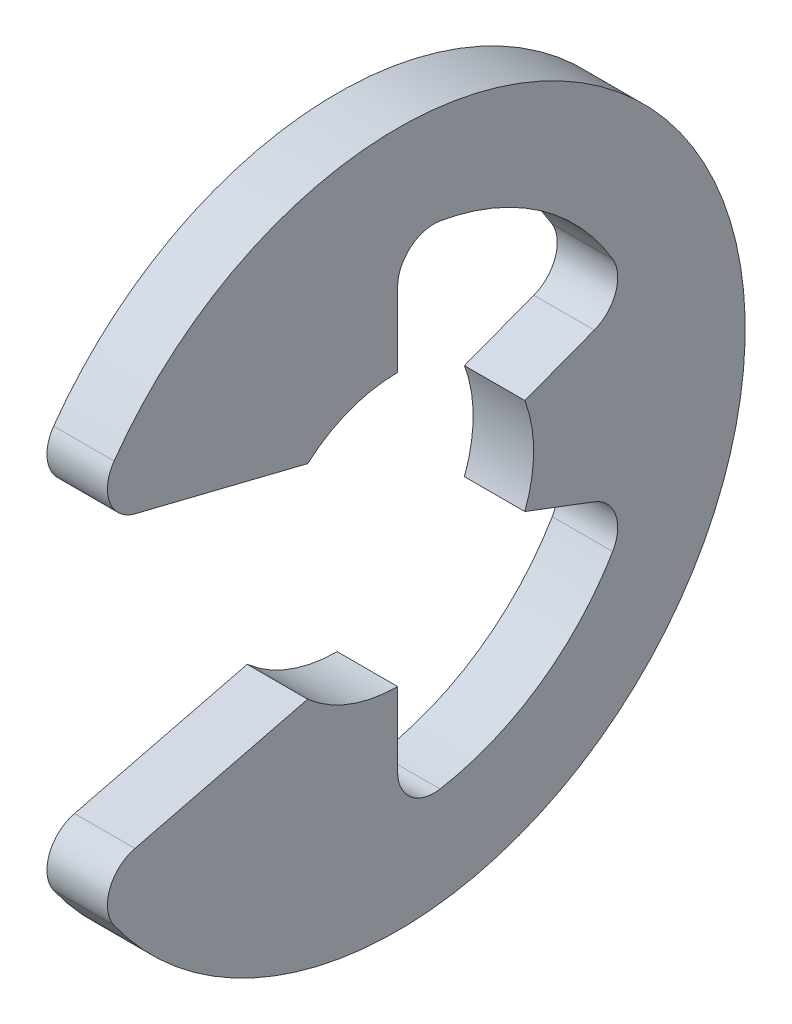
ISO-10303-21;
HEADER;
FILE_DESCRIPTION(('STEP AP214'),'2;1');
FILE_NAME('part.step','',(''),(''),'','','');
FILE_SCHEMA(('AUTOMOTIVE_DESIGN { 1 0 10303 214 1 1 1 1 }'));
ENDSEC;
DATA;
#1=APPLICATION_CONTEXT('core data for automotive mechanical design processes');
#2=APPLICATION_PROTOCOL_DEFINITION('international standard','automotive_design',2000,#1);
#3=PRODUCT_CONTEXT('',#1,'mechanical');
#4=PRODUCT('Part','Part','',(#3));
#5=PRODUCT_RELATED_PRODUCT_CATEGORY('part','',(#4));
#6=PRODUCT_DEFINITION_FORMATION('','',#4);
#7=PRODUCT_DEFINITION_CONTEXT('part definition',#1,'design');
#8=PRODUCT_DEFINITION('design','',#6,#7);
#9=PRODUCT_DEFINITION_SHAPE('','',#8);
#10=(LENGTH_UNIT() NAMED_UNIT(*) SI_UNIT(.MILLI.,.METRE.));
#11=(NAMED_UNIT(*) PLANE_ANGLE_UNIT() SI_UNIT($,.RADIAN.));
#12=(NAMED_UNIT(*) SI_UNIT($,.STERADIAN.) SOLID_ANGLE_UNIT());
#13=UNCERTAINTY_MEASURE_WITH_UNIT(LENGTH_MEASURE(1.E-05),#10,'distance_accuracy_value','');
#14=(GEOMETRIC_REPRESENTATION_CONTEXT(3) GLOBAL_UNCERTAINTY_ASSIGNED_CONTEXT((#13)) GLOBAL_UNIT_ASSIGNED_CONTEXT((#10,
#11,#12)) REPRESENTATION_CONTEXT('',''));
#15=CARTESIAN_POINT('',(0.,0.,0.));
#16=DIRECTION('',(0.,0.,1.));
#17=DIRECTION('',(1.,0.,0.));
#18=AXIS2_PLACEMENT_3D('',#15,#16,#17);
#19=CARTESIAN_POINT('',(-0.3,0.,0.));
#20=DIRECTION('',(-1.,0.,0.));
#21=DIRECTION('',(0.,0.,1.));
#22=AXIS2_PLACEMENT_3D('',#19,#20,#21);
#23=CYLINDRICAL_SURFACE('',#22,3.45);
#24=CARTESIAN_POINT('',(-0.3,0.,0.));
#25=DIRECTION('',(-1.,0.,0.));
#26=DIRECTION('',(0.,0.,1.));
#27=AXIS2_PLACEMENT_3D('',#24,#25,#26);
#28=CIRCLE('',#27,3.45);
#29=CARTESIAN_POINT('',(-0.30000000026632,1.99575242282437,2.81415569341688));
#30=VERTEX_POINT('',#29);
#31=CARTESIAN_POINT('',(-0.30000000026632,-1.99575242301035,2.81415569367911));
#32=VERTEX_POINT('',#31);
#33=EDGE_CURVE('E234',#30,#32,#28,.T.);
#34=ORIENTED_EDGE('',*,*,#33,.F.);
#35=DIRECTION('',(1.,0.,0.));
#36=VECTOR('',#35,1.);
#37=CARTESIAN_POINT('',(0.,1.99575242313794,2.8141556931945));
#38=LINE('',#37,#36);
#39=CARTESIAN_POINT('',(0.30000000026632,1.99575242282437,2.81415569341688));
#40=VERTEX_POINT('',#39);
#41=EDGE_CURVE('E194',#30,#40,#38,.T.);
#42=ORIENTED_EDGE('',*,*,#41,.T.);
#43=CARTESIAN_POINT('',(0.3,0.,0.));
#44=DIRECTION('',(-1.,0.,0.));
#45=DIRECTION('',(0.,0.,1.));
#46=AXIS2_PLACEMENT_3D('',#43,#44,#45);
#47=CIRCLE('',#46,3.45);
#48=CARTESIAN_POINT('',(0.30000000026632,-1.99575242291736,2.814155693548));
#49=VERTEX_POINT('',#48);
#50=EDGE_CURVE('E141',#49,#40,#47,.F.);
#51=ORIENTED_EDGE('',*,*,#50,.F.);
#52=DIRECTION('',(1.,0.,0.));
#53=VECTOR('',#52,1.);
#54=CARTESIAN_POINT('',(0.,-1.99575242332391,2.81415569345674));
#55=LINE('',#54,#53);
#56=EDGE_CURVE('E131',#32,#49,#55,.T.);
#57=ORIENTED_EDGE('',*,*,#56,.F.);
#58=EDGE_LOOP('',(#34,#42,#51,#57));
#59=FACE_BOUND('',#58,.T.);
#60=ADVANCED_FACE('F16',(#59),#23,.T.);
#61=CARTESIAN_POINT('',(-0.3,-1.787499996,2.520504665));
#62=DIRECTION('',(-1.,0.,0.));
#63=DIRECTION('',(0.,0.,1.));
#64=AXIS2_PLACEMENT_3D('',#61,#62,#63);
#65=CYLINDRICAL_SURFACE('',#64,0.36);
#66=DIRECTION('',(1.,0.,0.));
#67=VECTOR('',#66,1.);
#68=CARTESIAN_POINT('',(0.3,-1.43810673771699,2.60724767982199));
#69=LINE('',#68,#67);
#70=CARTESIAN_POINT('',(-0.30000000047706,-1.4381067374026,2.60724768008867));
#71=VERTEX_POINT('',#70);
#72=CARTESIAN_POINT('',(0.30000000047706,-1.4381067374026,2.60724768008867));
#73=VERTEX_POINT('',#72);
#74=EDGE_CURVE('E136',#71,#73,#69,.T.);
#75=ORIENTED_EDGE('',*,*,#74,.F.);
#76=CARTESIAN_POINT('',(-0.30000000047706,-1.787499996,2.520504665));
#77=DIRECTION('',(-1.,0.,0.));
#78=DIRECTION('',(0.,0.,1.));
#79=AXIS2_PLACEMENT_3D('',#76,#77,#78);
#80=CIRCLE('',#79,0.36);
#81=EDGE_CURVE('E232',#32,#71,#80,.T.);
#82=ORIENTED_EDGE('',*,*,#81,.F.);
#83=ORIENTED_EDGE('',*,*,#56,.T.);
#84=CARTESIAN_POINT('',(0.30000000047706,-1.787499996,2.520504665));
#85=DIRECTION('',(-1.,0.,0.));
#86=DIRECTION('',(0.,0.,1.));
#87=AXIS2_PLACEMENT_3D('',#84,#85,#86);
#88=CIRCLE('',#87,0.36);
#89=EDGE_CURVE('E19',#73,#49,#88,.F.);
#90=ORIENTED_EDGE('',*,*,#89,.F.);
#91=EDGE_LOOP('',(#75,#82,#83,#90));
#92=FACE_BOUND('',#91,.T.);
#93=ADVANCED_FACE('F135',(#92),#65,.T.);
#94=CARTESIAN_POINT('',(0.3,-1.555353856,3.079508789));
#95=DIRECTION('',(0.,-0.970536829837772,-0.240952820959724));
#96=DIRECTION('',(0.,0.240952820959724,-0.970536829837771));
#97=AXIS2_PLACEMENT_3D('',#94,#95,#96);
#98=PLANE('',#97);
#99=DIRECTION('',(0.,-0.240952820351647,0.970536829988737));
#100=VECTOR('',#99,1.);
#101=CARTESIAN_POINT('',(0.3,-1.0125,0.892941067));
#102=LINE('',#101,#100);
#103=CARTESIAN_POINT('',(0.3,-1.01250000016704,0.892941067294897));
#104=VERTEX_POINT('',#103);
#105=EDGE_CURVE('E142',#104,#73,#102,.T.);
#106=ORIENTED_EDGE('',*,*,#105,.F.);
#107=DIRECTION('',(1.,0.,0.));
#108=VECTOR('',#107,1.);
#109=CARTESIAN_POINT('',(0.,-1.01250000024025,0.89294106721188));
#110=LINE('',#109,#108);
#111=CARTESIAN_POINT('',(-0.3,-1.01250000016704,0.892941067294897));
#112=VERTEX_POINT('',#111);
#113=EDGE_CURVE('E149',#112,#104,#110,.T.);
#114=ORIENTED_EDGE('',*,*,#113,.F.);
#115=DIRECTION('',(0.,0.240952820351647,-0.970536829988737));
#116=VECTOR('',#115,1.);
#117=CARTESIAN_POINT('',(-0.3,-1.438106737,2.60724768));
#118=LINE('',#117,#116);
#119=EDGE_CURVE('E147',#71,#112,#118,.T.);
#120=ORIENTED_EDGE('',*,*,#119,.F.);
#121=ORIENTED_EDGE('',*,*,#74,.T.);
#122=EDGE_LOOP('',(#106,#114,#120,#121));
#123=FACE_BOUND('',#122,.T.);
#124=ADVANCED_FACE('F144',(#123),#98,.F.);
#125=CARTESIAN_POINT('',(0.3,0.,0.));
#126=DIRECTION('',(-1.,0.,0.));
#127=DIRECTION('',(0.,0.,1.));
#128=AXIS2_PLACEMENT_3D('',#125,#126,#127);
#129=CYLINDRICAL_SURFACE('',#128,1.35);
#130=CARTESIAN_POINT('',(0.3,0.,0.));
#131=DIRECTION('',(-1.,0.,0.));
#132=DIRECTION('',(0.,0.,1.));
#133=AXIS2_PLACEMENT_3D('',#130,#131,#132);
#134=CIRCLE('',#133,1.35);
#135=CARTESIAN_POINT('',(0.3,-1.35,0.));
#136=VERTEX_POINT('',#135);
#137=EDGE_CURVE('E155',#136,#104,#134,.T.);
#138=ORIENTED_EDGE('',*,*,#137,.F.);
#139=DIRECTION('',(1.,0.,0.));
#140=VECTOR('',#139,1.);
#141=CARTESIAN_POINT('',(0.3,-1.35,0.));
#142=LINE('',#141,#140);
#143=CARTESIAN_POINT('',(-0.3,-1.35,0.));
#144=VERTEX_POINT('',#143);
#145=EDGE_CURVE('E190',#144,#136,#142,.T.);
#146=ORIENTED_EDGE('',*,*,#145,.F.);
#147=CARTESIAN_POINT('',(-0.3,0.,0.));
#148=DIRECTION('',(-1.,0.,0.));
#149=DIRECTION('',(0.,0.,1.));
#150=AXIS2_PLACEMENT_3D('',#147,#148,#149);
#151=CIRCLE('',#150,1.35);
#152=EDGE_CURVE('E229',#112,#144,#151,.F.);
#153=ORIENTED_EDGE('',*,*,#152,.F.);
#154=ORIENTED_EDGE('',*,*,#113,.T.);
#155=EDGE_LOOP('',(#138,#146,#153,#154));
#156=FACE_BOUND('',#155,.T.);
#157=ADVANCED_FACE('F326',(#156),#129,.F.);
#158=CARTESIAN_POINT('',(0.3,-1.35,0.));
#159=DIRECTION('',(0.,0.,1.));
#160=DIRECTION('',(1.,0.,0.));
#161=AXIS2_PLACEMENT_3D('',#158,#159,#160);
#162=PLANE('',#161);
#163=DIRECTION('',(0.,1.,0.));
#164=VECTOR('',#163,1.);
#165=CARTESIAN_POINT('',(-0.3,0.,0.));
#166=LINE('',#165,#164);
#167=CARTESIAN_POINT('',(-0.3,-2.086591652,0.));
#168=VERTEX_POINT('',#167);
#169=EDGE_CURVE('E228',#144,#168,#166,.F.);
#170=ORIENTED_EDGE('',*,*,#169,.F.);
#171=ORIENTED_EDGE('',*,*,#145,.T.);
#172=DIRECTION('',(0.,1.,0.));
#173=VECTOR('',#172,1.);
#174=CARTESIAN_POINT('',(0.3,0.,0.));
#175=LINE('',#174,#173);
#176=CARTESIAN_POINT('',(0.3,-2.086591652,0.));
#177=VERTEX_POINT('',#176);
#178=EDGE_CURVE('E238',#177,#136,#175,.T.);
#179=ORIENTED_EDGE('',*,*,#178,.F.);
#180=DIRECTION('',(1.,0.,0.));
#181=VECTOR('',#180,1.);
#182=CARTESIAN_POINT('',(0.,-2.086591652,0.));
#183=LINE('',#182,#181);
#184=EDGE_CURVE('E188',#168,#177,#183,.T.);
#185=ORIENTED_EDGE('',*,*,#184,.F.);
#186=EDGE_LOOP('',(#170,#171,#179,#185));
#187=FACE_BOUND('',#186,.T.);
#188=ADVANCED_FACE('F322',(#187),#162,.F.);
#189=CARTESIAN_POINT('',(0.3,-2.086591652,-0.36));
#190=DIRECTION('',(-1.,0.,0.));
#191=DIRECTION('',(0.,0.,1.));
#192=AXIS2_PLACEMENT_3D('',#189,#190,#191);
#193=CYLINDRICAL_SURFACE('',#192,0.36);
#194=CARTESIAN_POINT('',(-0.3,-2.086591652,-0.36));
#195=DIRECTION('',(-1.,0.,0.));
#196=DIRECTION('',(0.,0.,1.));
#197=AXIS2_PLACEMENT_3D('',#194,#195,#196);
#198=CIRCLE('',#197,0.36);
#199=CARTESIAN_POINT('',(-0.3,-2.44135037970149,-0.421206581216385));
#200=VERTEX_POINT('',#199);
#201=EDGE_CURVE('E225',#168,#200,#198,.F.);
#202=ORIENTED_EDGE('',*,*,#201,.F.);
#203=ORIENTED_EDGE('',*,*,#184,.T.);
#204=CARTESIAN_POINT('',(0.3,-2.086591652,-0.36));
#205=DIRECTION('',(-1.,0.,0.));
#206=DIRECTION('',(0.,0.,1.));
#207=AXIS2_PLACEMENT_3D('',#204,#205,#206);
#208=CIRCLE('',#207,0.36);
#209=CARTESIAN_POINT('',(0.3,-2.44135037938356,-0.421206581161533));
#210=VERTEX_POINT('',#209);
#211=EDGE_CURVE('E239',#210,#177,#208,.T.);
#212=ORIENTED_EDGE('',*,*,#211,.F.);
#213=DIRECTION('',(1.,0.,0.));
#214=VECTOR('',#213,1.);
#215=CARTESIAN_POINT('',(0.,-2.44135037974637,-0.421206580956243));
#216=LINE('',#215,#214);
#217=EDGE_CURVE('E186',#200,#210,#216,.T.);
#218=ORIENTED_EDGE('',*,*,#217,.F.);
#219=EDGE_LOOP('',(#202,#203,#212,#218));
#220=FACE_BOUND('',#219,.T.);
#221=ADVANCED_FACE('F318',(#220),#193,.F.);
#222=CARTESIAN_POINT('',(0.3,0.,0.));
#223=DIRECTION('',(-1.,0.,0.));
#224=DIRECTION('',(0.,0.,1.));
#225=AXIS2_PLACEMENT_3D('',#222,#223,#224);
#226=CYLINDRICAL_SURFACE('',#225,2.477419355);
#227=CARTESIAN_POINT('',(0.3,0.,0.));
#228=DIRECTION('',(-1.,0.,0.));
#229=DIRECTION('',(0.,0.,1.));
#230=AXIS2_PLACEMENT_3D('',#227,#228,#229);
#231=CIRCLE('',#230,2.477419355);
#232=CARTESIAN_POINT('',(0.300000000106782,-1.25715038318439,-2.13475515555327));
#233=VERTEX_POINT('',#232);
#234=EDGE_CURVE('E242',#233,#210,#231,.T.);
#235=ORIENTED_EDGE('',*,*,#234,.F.);
#236=DIRECTION('',(1.,0.,0.));
#237=VECTOR('',#236,1.);
#238=CARTESIAN_POINT('',(0.,-1.2571503832457,-2.13475515541723));
#239=LINE('',#238,#237);
#240=CARTESIAN_POINT('',(-0.300000000106782,-1.25715038314069,-2.13475515547907));
#241=VERTEX_POINT('',#240);
#242=EDGE_CURVE('E184',#241,#233,#239,.T.);
#243=ORIENTED_EDGE('',*,*,#242,.F.);
#244=CARTESIAN_POINT('',(-0.3,0.,0.));
#245=DIRECTION('',(-1.,0.,0.));
#246=DIRECTION('',(0.,0.,1.));
#247=AXIS2_PLACEMENT_3D('',#244,#245,#246);
#248=CIRCLE('',#247,2.477419355);
#249=EDGE_CURVE('E222',#200,#241,#248,.F.);
#250=ORIENTED_EDGE('',*,*,#249,.F.);
#251=ORIENTED_EDGE('',*,*,#217,.T.);
#252=EDGE_LOOP('',(#235,#243,#250,#251));
#253=FACE_BOUND('',#252,.T.);
#254=ADVANCED_FACE('F314',(#253),#226,.F.);
#255=CARTESIAN_POINT('',(0.3,-1.074470718,-1.824548547));
#256=DIRECTION('',(-1.,0.,0.));
#257=DIRECTION('',(0.,0.,1.));
#258=AXIS2_PLACEMENT_3D('',#255,#256,#257);
#259=CYLINDRICAL_SURFACE('',#258,0.36);
#260=CARTESIAN_POINT('',(-0.30000000018253,-1.074470718,-1.824548547));
#261=DIRECTION('',(-1.,0.,0.));
#262=DIRECTION('',(0.,0.,1.));
#263=AXIS2_PLACEMENT_3D('',#260,#261,#262);
#264=CIRCLE('',#263,0.36);
#265=CARTESIAN_POINT('',(-0.30000000018253,-0.737721553813485,-1.95182776745112));
#266=VERTEX_POINT('',#265);
#267=EDGE_CURVE('E219',#241,#266,#264,.F.);
#268=ORIENTED_EDGE('',*,*,#267,.F.);
#269=ORIENTED_EDGE('',*,*,#242,.T.);
#270=CARTESIAN_POINT('',(0.30000000018253,-1.074470718,-1.824548547));
#271=DIRECTION('',(-1.,0.,0.));
#272=DIRECTION('',(0.,0.,1.));
#273=AXIS2_PLACEMENT_3D('',#270,#271,#272);
#274=CIRCLE('',#273,0.36);
#275=CARTESIAN_POINT('',(0.30000000018253,-0.737721553813485,-1.95182776745112));
#276=VERTEX_POINT('',#275);
#277=EDGE_CURVE('E245',#276,#233,#274,.T.);
#278=ORIENTED_EDGE('',*,*,#277,.F.);
#279=DIRECTION('',(1.,0.,0.));
#280=VECTOR('',#279,1.);
#281=CARTESIAN_POINT('',(0.3,-0.737721553375208,-1.95182776723615));
#282=LINE('',#281,#280);
#283=EDGE_CURVE('E182',#266,#276,#282,.T.);
#284=ORIENTED_EDGE('',*,*,#283,.F.);
#285=EDGE_LOOP('',(#268,#269,#278,#284));
#286=FACE_BOUND('',#285,.T.);
#287=ADVANCED_FACE('F311',(#286),#259,.F.);
#288=CARTESIAN_POINT('',(0.3,-0.477297077,-1.262809368));
#289=DIRECTION('',(0.,0.935414346597288,-0.353553390847789));
#290=DIRECTION('',(0.,0.353553390847789,0.935414346597288));
#291=AXIS2_PLACEMENT_3D('',#288,#289,#290);
#292=PLANE('',#291);
#293=DIRECTION('',(0.,-0.353553391696009,-0.935414346276691));
#294=VECTOR('',#293,1.);
#295=CARTESIAN_POINT('',(0.3,-0.477297077,-1.262809368));
#296=LINE('',#295,#294);
#297=CARTESIAN_POINT('',(0.3,-0.477297077049589,-1.2628093681312));
#298=VERTEX_POINT('',#297);
#299=EDGE_CURVE('E248',#298,#276,#296,.T.);
#300=ORIENTED_EDGE('',*,*,#299,.F.);
#301=DIRECTION('',(1.,0.,0.));
#302=VECTOR('',#301,1.);
#303=CARTESIAN_POINT('',(0.,-0.477297077049588,-1.2628093681312));
#304=LINE('',#303,#302);
#305=CARTESIAN_POINT('',(-0.3,-0.477297077049589,-1.2628093681312));
#306=VERTEX_POINT('',#305);
#307=EDGE_CURVE('E180',#306,#298,#304,.T.);
#308=ORIENTED_EDGE('',*,*,#307,.F.);
#309=DIRECTION('',(0.,0.353553391696009,0.935414346276691));
#310=VECTOR('',#309,1.);
#311=CARTESIAN_POINT('',(-0.3,-0.737721554,-1.951827767));
#312=LINE('',#311,#310);
#313=EDGE_CURVE('E218',#266,#306,#312,.T.);
#314=ORIENTED_EDGE('',*,*,#313,.F.);
#315=ORIENTED_EDGE('',*,*,#283,.T.);
#316=EDGE_LOOP('',(#300,#308,#314,#315));
#317=FACE_BOUND('',#316,.T.);
#318=ADVANCED_FACE('F306',(#317),#292,.F.);
#319=CARTESIAN_POINT('',(0.3,0.,0.));
#320=DIRECTION('',(-1.,0.,0.));
#321=DIRECTION('',(0.,0.,1.));
#322=AXIS2_PLACEMENT_3D('',#319,#320,#321);
#323=CYLINDRICAL_SURFACE('',#322,1.35);
#324=CARTESIAN_POINT('',(0.3,0.,0.));
#325=DIRECTION('',(-1.,0.,0.));
#326=DIRECTION('',(0.,0.,1.));
#327=AXIS2_PLACEMENT_3D('',#324,#325,#326);
#328=CIRCLE('',#327,1.35);
#329=CARTESIAN_POINT('',(0.3,0.477297077024794,-1.2628093680656));
#330=VERTEX_POINT('',#329);
#331=EDGE_CURVE('E249',#330,#298,#328,.T.);
#332=ORIENTED_EDGE('',*,*,#331,.F.);
#333=DIRECTION('',(1.,0.,0.));
#334=VECTOR('',#333,1.);
#335=CARTESIAN_POINT('',(0.3,0.477297077,-1.262809368));
#336=LINE('',#335,#334);
#337=CARTESIAN_POINT('',(-0.3,0.477297077024794,-1.2628093680656));
#338=VERTEX_POINT('',#337);
#339=EDGE_CURVE('E178',#338,#330,#336,.T.);
#340=ORIENTED_EDGE('',*,*,#339,.F.);
#341=CARTESIAN_POINT('',(-0.3,0.,0.));
#342=DIRECTION('',(-1.,0.,0.));
#343=DIRECTION('',(0.,0.,1.));
#344=AXIS2_PLACEMENT_3D('',#341,#342,#343);
#345=CIRCLE('',#344,1.35);
#346=EDGE_CURVE('E215',#306,#338,#345,.F.);
#347=ORIENTED_EDGE('',*,*,#346,.F.);
#348=ORIENTED_EDGE('',*,*,#307,.T.);
#349=EDGE_LOOP('',(#332,#340,#347,#348));
#350=FACE_BOUND('',#349,.T.);
#351=ADVANCED_FACE('F301',(#350),#323,.F.);
#352=CARTESIAN_POINT('',(0.3,0.477297077,-1.262809368));
#353=DIRECTION('',(0.,-0.935414346597288,-0.353553390847789));
#354=DIRECTION('',(0.,0.353553390847789,-0.935414346597288));
#355=AXIS2_PLACEMENT_3D('',#352,#353,#354);
#356=PLANE('',#355);
#357=DIRECTION('',(0.,0.353553391696009,-0.935414346276691));
#358=VECTOR('',#357,1.);
#359=CARTESIAN_POINT('',(-0.3,0.477297077,-1.262809368));
#360=LINE('',#359,#358);
#361=CARTESIAN_POINT('',(-0.30000000018253,0.737721553670196,-1.95182776750528));
#362=VERTEX_POINT('',#361);
#363=EDGE_CURVE('E214',#338,#362,#360,.T.);
#364=ORIENTED_EDGE('',*,*,#363,.F.);
#365=ORIENTED_EDGE('',*,*,#339,.T.);
#366=DIRECTION('',(0.,-0.353553391696009,0.935414346276691));
#367=VECTOR('',#366,1.);
#368=CARTESIAN_POINT('',(0.3,0.737721554,-1.951827767));
#369=LINE('',#368,#367);
#370=CARTESIAN_POINT('',(0.30000000018253,0.737721553670196,-1.95182776750528));
#371=VERTEX_POINT('',#370);
#372=EDGE_CURVE('E252',#371,#330,#369,.T.);
#373=ORIENTED_EDGE('',*,*,#372,.F.);
#374=DIRECTION('',(1.,0.,0.));
#375=VECTOR('',#374,1.);
#376=CARTESIAN_POINT('',(0.,0.73772155308863,-1.95182776734447));
#377=LINE('',#376,#375);
#378=EDGE_CURVE('E176',#362,#371,#377,.T.);
#379=ORIENTED_EDGE('',*,*,#378,.F.);
#380=EDGE_LOOP('',(#364,#365,#373,#379));
#381=FACE_BOUND('',#380,.T.);
#382=ADVANCED_FACE('F296',(#381),#356,.F.);
#383=CARTESIAN_POINT('',(0.3,1.074470718,-1.824548547));
#384=DIRECTION('',(-1.,0.,0.));
#385=DIRECTION('',(0.,0.,1.));
#386=AXIS2_PLACEMENT_3D('',#383,#384,#385);
#387=CYLINDRICAL_SURFACE('',#386,0.36);
#388=CARTESIAN_POINT('',(-0.30000000018253,1.074470718,-1.824548547));
#389=DIRECTION('',(-1.,0.,0.));
#390=DIRECTION('',(0.,0.,1.));
#391=AXIS2_PLACEMENT_3D('',#388,#389,#390);
#392=CIRCLE('',#391,0.36);
#393=CARTESIAN_POINT('',(-0.300000000106782,1.25715038322809,-2.13475515562748));
#394=VERTEX_POINT('',#393);
#395=EDGE_CURVE('E211',#362,#394,#392,.F.);
#396=ORIENTED_EDGE('',*,*,#395,.F.);
#397=ORIENTED_EDGE('',*,*,#378,.T.);
#398=CARTESIAN_POINT('',(0.30000000018253,1.074470718,-1.824548547));
#399=DIRECTION('',(-1.,0.,0.));
#400=DIRECTION('',(0.,0.,1.));
#401=AXIS2_PLACEMENT_3D('',#398,#399,#400);
#402=CIRCLE('',#401,0.36);
#403=CARTESIAN_POINT('',(0.300000000106782,1.25715038318439,-2.13475515555327));
#404=VERTEX_POINT('',#403);
#405=EDGE_CURVE('E253',#404,#371,#402,.T.);
#406=ORIENTED_EDGE('',*,*,#405,.F.);
#407=DIRECTION('',(1.,0.,0.));
#408=VECTOR('',#407,1.);
#409=CARTESIAN_POINT('',(0.,1.2571503833331,-2.13475515556563));
#410=LINE('',#409,#408);
#411=EDGE_CURVE('E174',#394,#404,#410,.T.);
#412=ORIENTED_EDGE('',*,*,#411,.F.);
#413=EDGE_LOOP('',(#396,#397,#406,#412));
#414=FACE_BOUND('',#413,.T.);
#415=ADVANCED_FACE('F333',(#414),#387,.F.);
#416=CARTESIAN_POINT('',(0.3,0.,0.));
#417=DIRECTION('',(-1.,0.,0.));
#418=DIRECTION('',(0.,0.,1.));
#419=AXIS2_PLACEMENT_3D('',#416,#417,#418);
#420=CYLINDRICAL_SURFACE('',#419,2.477419355);
#421=CARTESIAN_POINT('',(-0.3,0.,0.));
#422=DIRECTION('',(-1.,0.,0.));
#423=DIRECTION('',(0.,0.,1.));
#424=AXIS2_PLACEMENT_3D('',#421,#422,#423);
#425=CIRCLE('',#424,2.477419355);
#426=CARTESIAN_POINT('',(-0.3,2.44135037906564,-0.421206581106681));
#427=VERTEX_POINT('',#426);
#428=EDGE_CURVE('E208',#394,#427,#425,.F.);
#429=ORIENTED_EDGE('',*,*,#428,.F.);
#430=ORIENTED_EDGE('',*,*,#411,.T.);
#431=CARTESIAN_POINT('',(0.3,0.,0.));
#432=DIRECTION('',(-1.,0.,0.));
#433=DIRECTION('',(0.,0.,1.));
#434=AXIS2_PLACEMENT_3D('',#431,#432,#433);
#435=CIRCLE('',#434,2.477419355);
#436=CARTESIAN_POINT('',(0.3,2.44135037938356,-0.421206581161533));
#437=VERTEX_POINT('',#436);
#438=EDGE_CURVE('E256',#437,#404,#435,.T.);
#439=ORIENTED_EDGE('',*,*,#438,.F.);
#440=DIRECTION('',(1.,0.,0.));
#441=VECTOR('',#440,1.);
#442=CARTESIAN_POINT('',(0.,2.44135037911052,-0.421206580846538));
#443=LINE('',#442,#441);
#444=EDGE_CURVE('E158',#427,#437,#443,.T.);
#445=ORIENTED_EDGE('',*,*,#444,.F.);
#446=EDGE_LOOP('',(#429,#430,#439,#445));
#447=FACE_BOUND('',#446,.T.);
#448=ADVANCED_FACE('F336',(#447),#420,.F.);
#449=CARTESIAN_POINT('',(0.3,2.086591652,-0.36));
#450=DIRECTION('',(-1.,0.,0.));
#451=DIRECTION('',(0.,0.,1.));
#452=AXIS2_PLACEMENT_3D('',#449,#450,#451);
#453=CYLINDRICAL_SURFACE('',#452,0.36);
#454=CARTESIAN_POINT('',(-0.3,2.086591652,-0.36));
#455=DIRECTION('',(-1.,0.,0.));
#456=DIRECTION('',(0.,0.,1.));
#457=AXIS2_PLACEMENT_3D('',#454,#455,#456);
#458=CIRCLE('',#457,0.36);
#459=CARTESIAN_POINT('',(-0.3,2.086591652,0.));
#460=VERTEX_POINT('',#459);
#461=EDGE_CURVE('E205',#427,#460,#458,.F.);
#462=ORIENTED_EDGE('',*,*,#461,.F.);
#463=ORIENTED_EDGE('',*,*,#444,.T.);
#464=CARTESIAN_POINT('',(0.3,2.086591652,-0.36));
#465=DIRECTION('',(-1.,0.,0.));
#466=DIRECTION('',(0.,0.,1.));
#467=AXIS2_PLACEMENT_3D('',#464,#465,#466);
#468=CIRCLE('',#467,0.36);
#469=CARTESIAN_POINT('',(0.3,2.086591652,0.));
#470=VERTEX_POINT('',#469);
#471=EDGE_CURVE('E259',#470,#437,#468,.T.);
#472=ORIENTED_EDGE('',*,*,#471,.F.);
#473=DIRECTION('',(1.,0.,0.));
#474=VECTOR('',#473,1.);
#475=CARTESIAN_POINT('',(0.3,2.086591652,0.));
#476=LINE('',#475,#474);
#477=EDGE_CURVE('E156',#460,#470,#476,.T.);
#478=ORIENTED_EDGE('',*,*,#477,.F.);
#479=EDGE_LOOP('',(#462,#463,#472,#478));
#480=FACE_BOUND('',#479,.T.);
#481=ADVANCED_FACE('F339',(#480),#453,.F.);
#482=CARTESIAN_POINT('',(0.3,1.35,0.));
#483=DIRECTION('',(0.,0.,1.));
#484=DIRECTION('',(1.,0.,0.));
#485=AXIS2_PLACEMENT_3D('',#482,#483,#484);
#486=PLANE('',#485);
#487=DIRECTION('',(0.,1.,0.));
#488=VECTOR('',#487,1.);
#489=CARTESIAN_POINT('',(0.3,0.,0.));
#490=LINE('',#489,#488);
#491=CARTESIAN_POINT('',(0.3,1.35,0.));
#492=VERTEX_POINT('',#491);
#493=EDGE_CURVE('E162',#492,#470,#490,.T.);
#494=ORIENTED_EDGE('',*,*,#493,.F.);
#495=DIRECTION('',(1.,0.,0.));
#496=VECTOR('',#495,1.);
#497=CARTESIAN_POINT('',(0.,1.35,0.));
#498=LINE('',#497,#496);
#499=CARTESIAN_POINT('',(-0.3,1.35,0.));
#500=VERTEX_POINT('',#499);
#501=EDGE_CURVE('E168',#500,#492,#498,.T.);
#502=ORIENTED_EDGE('',*,*,#501,.F.);
#503=DIRECTION('',(0.,1.,0.));
#504=VECTOR('',#503,1.);
#505=CARTESIAN_POINT('',(-0.3,0.,0.));
#506=LINE('',#505,#504);
#507=EDGE_CURVE('E204',#460,#500,#506,.F.);
#508=ORIENTED_EDGE('',*,*,#507,.F.);
#509=ORIENTED_EDGE('',*,*,#477,.T.);
#510=EDGE_LOOP('',(#494,#502,#508,#509));
#511=FACE_BOUND('',#510,.T.);
#512=ADVANCED_FACE('F268',(#511),#486,.F.);
#513=CARTESIAN_POINT('',(0.3,0.,0.));
#514=DIRECTION('',(1.,0.,0.));
#515=DIRECTION('',(0.,0.,-1.));
#516=AXIS2_PLACEMENT_3D('',#513,#514,#515);
#517=PLANE('',#516);
#518=ORIENTED_EDGE('',*,*,#178,.T.);
#519=ORIENTED_EDGE('',*,*,#137,.T.);
#520=ORIENTED_EDGE('',*,*,#105,.T.);
#521=ORIENTED_EDGE('',*,*,#89,.T.);
#522=ORIENTED_EDGE('',*,*,#50,.T.);
#523=CARTESIAN_POINT('',(0.30000000047706,1.787499996,2.520504665));
#524=DIRECTION('',(-1.,0.,0.));
#525=DIRECTION('',(0.,0.,1.));
#526=AXIS2_PLACEMENT_3D('',#523,#524,#525);
#527=CIRCLE('',#526,0.36);
#528=CARTESIAN_POINT('',(0.30000000047706,1.4381067374877,2.60724768018375));
#529=VERTEX_POINT('',#528);
#530=EDGE_CURVE('E197',#529,#40,#527,.T.);
#531=ORIENTED_EDGE('',*,*,#530,.F.);
#532=DIRECTION('',(0.,0.240952820959724,0.970536829837771));
#533=VECTOR('',#532,1.);
#534=CARTESIAN_POINT('',(0.3,1.555353856,3.079508789));
#535=LINE('',#534,#533);
#536=CARTESIAN_POINT('',(0.3,1.01249999972046,0.892941067400998));
#537=VERTEX_POINT('',#536);
#538=EDGE_CURVE('E164',#537,#529,#535,.T.);
#539=ORIENTED_EDGE('',*,*,#538,.F.);
#540=CARTESIAN_POINT('',(0.3,0.,0.));
#541=DIRECTION('',(-1.,0.,0.));
#542=DIRECTION('',(0.,0.,1.));
#543=AXIS2_PLACEMENT_3D('',#540,#541,#542);
#544=CIRCLE('',#543,1.35);
#545=EDGE_CURVE('E170',#492,#537,#544,.F.);
#546=ORIENTED_EDGE('',*,*,#545,.F.);
#547=ORIENTED_EDGE('',*,*,#493,.T.);
#548=ORIENTED_EDGE('',*,*,#471,.T.);
#549=ORIENTED_EDGE('',*,*,#438,.T.);
#550=ORIENTED_EDGE('',*,*,#405,.T.);
#551=ORIENTED_EDGE('',*,*,#372,.T.);
#552=ORIENTED_EDGE('',*,*,#331,.T.);
#553=ORIENTED_EDGE('',*,*,#299,.T.);
#554=ORIENTED_EDGE('',*,*,#277,.T.);
#555=ORIENTED_EDGE('',*,*,#234,.T.);
#556=ORIENTED_EDGE('',*,*,#211,.T.);
#557=EDGE_LOOP('',(#518,#519,#520,#521,#522,#531,#539,#546,#547,#548,#549,#550,#551,#552,#553,
#554,#555,#556));
#558=FACE_BOUND('',#557,.T.);
#559=ADVANCED_FACE('F153',(#558),#517,.T.);
#560=CARTESIAN_POINT('',(-0.3,0.,0.));
#561=DIRECTION('',(1.,0.,0.));
#562=DIRECTION('',(0.,0.,-1.));
#563=AXIS2_PLACEMENT_3D('',#560,#561,#562);
#564=PLANE('',#563);
#565=DIRECTION('',(0.,0.240952820959724,0.970536829837771));
#566=VECTOR('',#565,1.);
#567=CARTESIAN_POINT('',(-0.3,1.555353856,3.079508789));
#568=LINE('',#567,#566);
#569=CARTESIAN_POINT('',(-0.30000000047706,1.4381067374877,2.60724768018375));
#570=VERTEX_POINT('',#569);
#571=CARTESIAN_POINT('',(-0.3,1.01249999972046,0.892941067400998));
#572=VERTEX_POINT('',#571);
#573=EDGE_CURVE('E167',#570,#572,#568,.F.);
#574=ORIENTED_EDGE('',*,*,#573,.F.);
#575=CARTESIAN_POINT('',(-0.30000000047706,1.787499996,2.520504665));
#576=DIRECTION('',(-1.,0.,0.));
#577=DIRECTION('',(0.,0.,1.));
#578=AXIS2_PLACEMENT_3D('',#575,#576,#577);
#579=CIRCLE('',#578,0.36);
#580=EDGE_CURVE('E33',#30,#570,#579,.F.);
#581=ORIENTED_EDGE('',*,*,#580,.F.);
#582=ORIENTED_EDGE('',*,*,#33,.T.);
#583=ORIENTED_EDGE('',*,*,#81,.T.);
#584=ORIENTED_EDGE('',*,*,#119,.T.);
#585=ORIENTED_EDGE('',*,*,#152,.T.);
#586=ORIENTED_EDGE('',*,*,#169,.T.);
#587=ORIENTED_EDGE('',*,*,#201,.T.);
#588=ORIENTED_EDGE('',*,*,#249,.T.);
#589=ORIENTED_EDGE('',*,*,#267,.T.);
#590=ORIENTED_EDGE('',*,*,#313,.T.);
#591=ORIENTED_EDGE('',*,*,#346,.T.);
#592=ORIENTED_EDGE('',*,*,#363,.T.);
#593=ORIENTED_EDGE('',*,*,#395,.T.);
#594=ORIENTED_EDGE('',*,*,#428,.T.);
#595=ORIENTED_EDGE('',*,*,#461,.T.);
#596=ORIENTED_EDGE('',*,*,#507,.T.);
#597=CARTESIAN_POINT('',(-0.3,0.,0.));
#598=DIRECTION('',(-1.,0.,0.));
#599=DIRECTION('',(0.,0.,1.));
#600=AXIS2_PLACEMENT_3D('',#597,#598,#599);
#601=CIRCLE('',#600,1.35);
#602=EDGE_CURVE('E171',#572,#500,#601,.T.);
#603=ORIENTED_EDGE('',*,*,#602,.F.);
#604=EDGE_LOOP('',(#574,#581,#582,#583,#584,#585,#586,#587,#588,#589,#590,#591,#592,#593,#594,
#595,#596,#603));
#605=FACE_BOUND('',#604,.T.);
#606=ADVANCED_FACE('F276',(#605),#564,.F.);
#607=CARTESIAN_POINT('',(0.3,0.,0.));
#608=DIRECTION('',(-1.,0.,0.));
#609=DIRECTION('',(0.,0.,1.));
#610=AXIS2_PLACEMENT_3D('',#607,#608,#609);
#611=CYLINDRICAL_SURFACE('',#610,1.35);
#612=ORIENTED_EDGE('',*,*,#545,.T.);
#613=DIRECTION('',(1.,0.,0.));
#614=VECTOR('',#613,1.);
#615=CARTESIAN_POINT('',(0.3,1.01249999964291,0.892941067088654));
#616=LINE('',#615,#614);
#617=EDGE_CURVE('E25',#572,#537,#616,.T.);
#618=ORIENTED_EDGE('',*,*,#617,.F.);
#619=ORIENTED_EDGE('',*,*,#602,.T.);
#620=ORIENTED_EDGE('',*,*,#501,.T.);
#621=EDGE_LOOP('',(#612,#618,#619,#620));
#622=FACE_BOUND('',#621,.T.);
#623=ADVANCED_FACE('F281',(#622),#611,.F.);
#624=CARTESIAN_POINT('',(0.3,1.555353856,3.079508789));
#625=DIRECTION('',(0.,0.970536829837772,-0.240952820959724));
#626=DIRECTION('',(0.,0.240952820959724,0.970536829837771));
#627=AXIS2_PLACEMENT_3D('',#624,#625,#626);
#628=PLANE('',#627);
#629=ORIENTED_EDGE('',*,*,#573,.T.);
#630=ORIENTED_EDGE('',*,*,#617,.T.);
#631=ORIENTED_EDGE('',*,*,#538,.T.);
#632=DIRECTION('',(1.,0.,0.));
#633=VECTOR('',#632,1.);
#634=CARTESIAN_POINT('',(0.,1.43810673711583,2.60724767997124));
#635=LINE('',#634,#633);
#636=EDGE_CURVE('E11',#570,#529,#635,.T.);
#637=ORIENTED_EDGE('',*,*,#636,.F.);
#638=EDGE_LOOP('',(#629,#630,#631,#637));
#639=FACE_BOUND('',#638,.T.);
#640=ADVANCED_FACE('F284',(#639),#628,.F.);
#641=CARTESIAN_POINT('',(-0.3,1.787499996,2.520504665));
#642=DIRECTION('',(-1.,0.,0.));
#643=DIRECTION('',(0.,0.,1.));
#644=AXIS2_PLACEMENT_3D('',#641,#642,#643);
#645=CYLINDRICAL_SURFACE('',#644,0.36);
#646=ORIENTED_EDGE('',*,*,#580,.T.);
#647=ORIENTED_EDGE('',*,*,#636,.T.);
#648=ORIENTED_EDGE('',*,*,#530,.T.);
#649=ORIENTED_EDGE('',*,*,#41,.F.);
#650=EDGE_LOOP('',(#646,#647,#648,#649));
#651=FACE_BOUND('',#650,.T.);
#652=ADVANCED_FACE('F349',(#651),#645,.T.);
#653=CLOSED_SHELL('',(#60,#93,#124,#157,#188,#221,#254,#287,#318,#351,#382,#415,#448,#481,#512,
#559,#606,#623,#640,#652));
#654=MANIFOLD_SOLID_BREP('B1',#653);
#655=ADVANCED_BREP_SHAPE_REPRESENTATION('',(#18,#654),#14);
#656=SHAPE_DEFINITION_REPRESENTATION(#9,#655);
ENDSEC;
END-ISO-10303-21;
